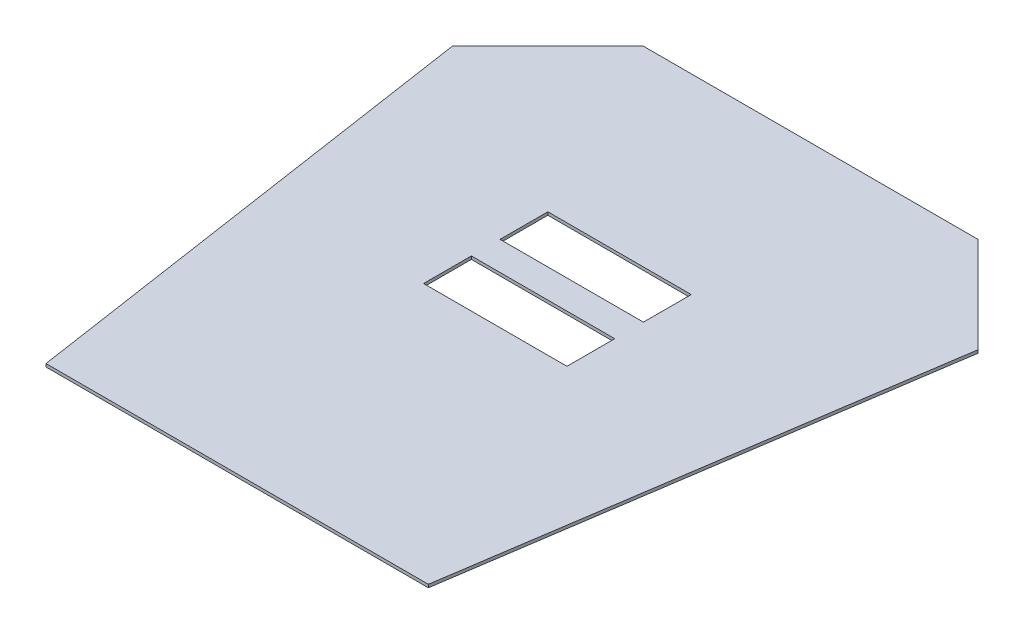
ISO-10303-21;
HEADER;
FILE_DESCRIPTION(('STEP AP214'),'2;1');
FILE_NAME('part.step','',(''),(''),'','','');
FILE_SCHEMA(('AUTOMOTIVE_DESIGN { 1 0 10303 214 1 1 1 1 }'));
ENDSEC;
DATA;
#1=APPLICATION_CONTEXT('core data for automotive mechanical design processes');
#2=APPLICATION_PROTOCOL_DEFINITION('international standard','automotive_design',2000,#1);
#3=PRODUCT_CONTEXT('',#1,'mechanical');
#4=PRODUCT('Part','Part','',(#3));
#5=PRODUCT_RELATED_PRODUCT_CATEGORY('part','',(#4));
#6=PRODUCT_DEFINITION_FORMATION('','',#4);
#7=PRODUCT_DEFINITION_CONTEXT('part definition',#1,'design');
#8=PRODUCT_DEFINITION('design','',#6,#7);
#9=PRODUCT_DEFINITION_SHAPE('','',#8);
#10=(LENGTH_UNIT() NAMED_UNIT(*) SI_UNIT(.MILLI.,.METRE.));
#11=(NAMED_UNIT(*) PLANE_ANGLE_UNIT() SI_UNIT($,.RADIAN.));
#12=(NAMED_UNIT(*) SI_UNIT($,.STERADIAN.) SOLID_ANGLE_UNIT());
#13=UNCERTAINTY_MEASURE_WITH_UNIT(LENGTH_MEASURE(1.E-05),#10,'distance_accuracy_value','');
#14=(GEOMETRIC_REPRESENTATION_CONTEXT(3) GLOBAL_UNCERTAINTY_ASSIGNED_CONTEXT((#13)) GLOBAL_UNIT_ASSIGNED_CONTEXT((#10,
#11,#12)) REPRESENTATION_CONTEXT('',''));
#15=CARTESIAN_POINT('',(0.,0.,0.));
#16=DIRECTION('',(0.,0.,1.));
#17=DIRECTION('',(1.,0.,0.));
#18=AXIS2_PLACEMENT_3D('',#15,#16,#17);
#19=CARTESIAN_POINT('',(175.,3.175,-100.));
#20=DIRECTION('',(-0.707106781186547,0.,0.707106781186548));
#21=DIRECTION('',(0.707106781186548,0.,0.707106781186547));
#22=AXIS2_PLACEMENT_3D('',#19,#20,#21);
#23=PLANE('',#22);
#24=DIRECTION('',(-0.707106781186548,0.,-0.707106781186547));
#25=VECTOR('',#24,1.);
#26=CARTESIAN_POINT('',(175.,0.,-100.));
#27=LINE('',#26,#25);
#28=CARTESIAN_POINT('',(275.,0.,0.));
#29=VERTEX_POINT('',#28);
#30=CARTESIAN_POINT('',(175.,0.,-100.));
#31=VERTEX_POINT('',#30);
#32=EDGE_CURVE('E165',#29,#31,#27,.T.);
#33=ORIENTED_EDGE('',*,*,#32,.T.);
#34=DIRECTION('',(0.,-1.,0.));
#35=VECTOR('',#34,1.);
#36=CARTESIAN_POINT('',(175.,3.175,-100.));
#37=LINE('',#36,#35);
#38=CARTESIAN_POINT('',(175.,3.175,-100.));
#39=VERTEX_POINT('',#38);
#40=EDGE_CURVE('E226',#39,#31,#37,.T.);
#41=ORIENTED_EDGE('',*,*,#40,.F.);
#42=DIRECTION('',(-0.707106781186548,0.,-0.707106781186547));
#43=VECTOR('',#42,1.);
#44=CARTESIAN_POINT('',(175.,3.175,-100.));
#45=LINE('',#44,#43);
#46=CARTESIAN_POINT('',(275.,3.175,0.));
#47=VERTEX_POINT('',#46);
#48=EDGE_CURVE('E186',#47,#39,#45,.T.);
#49=ORIENTED_EDGE('',*,*,#48,.F.);
#50=DIRECTION('',(0.,-1.,0.));
#51=VECTOR('',#50,1.);
#52=CARTESIAN_POINT('',(275.,3.175,0.));
#53=LINE('',#52,#51);
#54=EDGE_CURVE('E200',#47,#29,#53,.T.);
#55=ORIENTED_EDGE('',*,*,#54,.T.);
#56=EDGE_LOOP('',(#33,#41,#49,#55));
#57=FACE_BOUND('',#56,.T.);
#58=ADVANCED_FACE('F35',(#57),#23,.F.);
#59=CARTESIAN_POINT('',(-175.,3.175,-99.9999999999999));
#60=DIRECTION('',(0.,0.,1.));
#61=DIRECTION('',(1.,0.,0.));
#62=AXIS2_PLACEMENT_3D('',#59,#60,#61);
#63=PLANE('',#62);
#64=DIRECTION('',(-1.,0.,0.));
#65=VECTOR('',#64,1.);
#66=CARTESIAN_POINT('',(-175.,0.,-99.9999999999999));
#67=LINE('',#66,#65);
#68=CARTESIAN_POINT('',(-175.,0.,-99.9999999999999));
#69=VERTEX_POINT('',#68);
#70=EDGE_CURVE('E203',#31,#69,#67,.T.);
#71=ORIENTED_EDGE('',*,*,#70,.T.);
#72=DIRECTION('',(0.,-1.,0.));
#73=VECTOR('',#72,1.);
#74=CARTESIAN_POINT('',(-175.,3.175,-99.9999999999999));
#75=LINE('',#74,#73);
#76=CARTESIAN_POINT('',(-175.,3.175,-99.9999999999999));
#77=VERTEX_POINT('',#76);
#78=EDGE_CURVE('E223',#77,#69,#75,.T.);
#79=ORIENTED_EDGE('',*,*,#78,.F.);
#80=DIRECTION('',(-1.,0.,0.));
#81=VECTOR('',#80,1.);
#82=CARTESIAN_POINT('',(-175.,3.175,-99.9999999999999));
#83=LINE('',#82,#81);
#84=EDGE_CURVE('E189',#39,#77,#83,.T.);
#85=ORIENTED_EDGE('',*,*,#84,.F.);
#86=ORIENTED_EDGE('',*,*,#40,.T.);
#87=EDGE_LOOP('',(#71,#79,#85,#86));
#88=FACE_BOUND('',#87,.T.);
#89=ADVANCED_FACE('F263',(#88),#63,.F.);
#90=CARTESIAN_POINT('',(-175.,3.175,-99.9999999999999));
#91=DIRECTION('',(0.707106781186547,0.,0.707106781186548));
#92=DIRECTION('',(0.707106781186548,0.,-0.707106781186547));
#93=AXIS2_PLACEMENT_3D('',#90,#91,#92);
#94=PLANE('',#93);
#95=DIRECTION('',(-0.707106781186548,0.,0.707106781186547));
#96=VECTOR('',#95,1.);
#97=CARTESIAN_POINT('',(-175.,0.,-99.9999999999999));
#98=LINE('',#97,#96);
#99=CARTESIAN_POINT('',(-275.,0.,0.));
#100=VERTEX_POINT('',#99);
#101=EDGE_CURVE('E205',#69,#100,#98,.T.);
#102=ORIENTED_EDGE('',*,*,#101,.T.);
#103=DIRECTION('',(0.,-1.,0.));
#104=VECTOR('',#103,1.);
#105=CARTESIAN_POINT('',(-275.,3.175,0.));
#106=LINE('',#105,#104);
#107=CARTESIAN_POINT('',(-275.,3.175,0.));
#108=VERTEX_POINT('',#107);
#109=EDGE_CURVE('E220',#108,#100,#106,.T.);
#110=ORIENTED_EDGE('',*,*,#109,.F.);
#111=DIRECTION('',(-0.707106781186548,0.,0.707106781186547));
#112=VECTOR('',#111,1.);
#113=CARTESIAN_POINT('',(-175.,3.175,-99.9999999999999));
#114=LINE('',#113,#112);
#115=EDGE_CURVE('E192',#77,#108,#114,.T.);
#116=ORIENTED_EDGE('',*,*,#115,.F.);
#117=ORIENTED_EDGE('',*,*,#78,.T.);
#118=EDGE_LOOP('',(#102,#110,#116,#117));
#119=FACE_BOUND('',#118,.T.);
#120=ADVANCED_FACE('F268',(#119),#94,.F.);
#121=CARTESIAN_POINT('',(-275.,3.175,0.));
#122=DIRECTION('',(0.988936352868297,0.,-0.148340452930245));
#123=DIRECTION('',(-0.148340452930245,0.,-0.988936352868298));
#124=AXIS2_PLACEMENT_3D('',#121,#122,#123);
#125=PLANE('',#124);
#126=DIRECTION('',(0.148340452930245,0.,0.988936352868298));
#127=VECTOR('',#126,1.);
#128=CARTESIAN_POINT('',(-275.,0.,0.));
#129=LINE('',#128,#127);
#130=CARTESIAN_POINT('',(-200.,0.,500.));
#131=VERTEX_POINT('',#130);
#132=EDGE_CURVE('E207',#100,#131,#129,.T.);
#133=ORIENTED_EDGE('',*,*,#132,.T.);
#134=DIRECTION('',(0.,-1.,0.));
#135=VECTOR('',#134,1.);
#136=CARTESIAN_POINT('',(-200.,3.175,500.));
#137=LINE('',#136,#135);
#138=CARTESIAN_POINT('',(-200.,3.175,500.));
#139=VERTEX_POINT('',#138);
#140=EDGE_CURVE('E217',#139,#131,#137,.T.);
#141=ORIENTED_EDGE('',*,*,#140,.F.);
#142=DIRECTION('',(0.148340452930245,0.,0.988936352868298));
#143=VECTOR('',#142,1.);
#144=CARTESIAN_POINT('',(-275.,3.175,0.));
#145=LINE('',#144,#143);
#146=EDGE_CURVE('E194',#108,#139,#145,.T.);
#147=ORIENTED_EDGE('',*,*,#146,.F.);
#148=ORIENTED_EDGE('',*,*,#109,.T.);
#149=EDGE_LOOP('',(#133,#141,#147,#148));
#150=FACE_BOUND('',#149,.T.);
#151=ADVANCED_FACE('F291',(#150),#125,.F.);
#152=CARTESIAN_POINT('',(200.,3.175,500.));
#153=DIRECTION('',(0.,0.,-1.));
#154=DIRECTION('',(-1.,0.,0.));
#155=AXIS2_PLACEMENT_3D('',#152,#153,#154);
#156=PLANE('',#155);
#157=DIRECTION('',(1.,0.,0.));
#158=VECTOR('',#157,1.);
#159=CARTESIAN_POINT('',(200.,0.,500.));
#160=LINE('',#159,#158);
#161=CARTESIAN_POINT('',(200.,0.,500.));
#162=VERTEX_POINT('',#161);
#163=EDGE_CURVE('E209',#131,#162,#160,.T.);
#164=ORIENTED_EDGE('',*,*,#163,.T.);
#165=DIRECTION('',(0.,-1.,0.));
#166=VECTOR('',#165,1.);
#167=CARTESIAN_POINT('',(200.,3.175,500.));
#168=LINE('',#167,#166);
#169=CARTESIAN_POINT('',(200.,3.175,500.));
#170=VERTEX_POINT('',#169);
#171=EDGE_CURVE('E214',#170,#162,#168,.T.);
#172=ORIENTED_EDGE('',*,*,#171,.F.);
#173=DIRECTION('',(1.,0.,0.));
#174=VECTOR('',#173,1.);
#175=CARTESIAN_POINT('',(200.,3.175,500.));
#176=LINE('',#175,#174);
#177=EDGE_CURVE('E196',#139,#170,#176,.T.);
#178=ORIENTED_EDGE('',*,*,#177,.F.);
#179=ORIENTED_EDGE('',*,*,#140,.T.);
#180=EDGE_LOOP('',(#164,#172,#178,#179));
#181=FACE_BOUND('',#180,.T.);
#182=ADVANCED_FACE('F288',(#181),#156,.F.);
#183=CARTESIAN_POINT('',(275.,3.175,0.));
#184=DIRECTION('',(-0.988936352868297,0.,-0.148340452930244));
#185=DIRECTION('',(-0.148340452930245,0.,0.988936352868298));
#186=AXIS2_PLACEMENT_3D('',#183,#184,#185);
#187=PLANE('',#186);
#188=DIRECTION('',(0.148340452930244,0.,-0.988936352868298));
#189=VECTOR('',#188,1.);
#190=CARTESIAN_POINT('',(275.,0.,0.));
#191=LINE('',#190,#189);
#192=EDGE_CURVE('E190',#162,#29,#191,.T.);
#193=ORIENTED_EDGE('',*,*,#192,.T.);
#194=ORIENTED_EDGE('',*,*,#54,.F.);
#195=DIRECTION('',(0.148340452930244,0.,-0.988936352868298));
#196=VECTOR('',#195,1.);
#197=CARTESIAN_POINT('',(275.,3.175,0.));
#198=LINE('',#197,#196);
#199=EDGE_CURVE('E198',#170,#47,#198,.T.);
#200=ORIENTED_EDGE('',*,*,#199,.F.);
#201=ORIENTED_EDGE('',*,*,#171,.T.);
#202=EDGE_LOOP('',(#193,#194,#200,#201));
#203=FACE_BOUND('',#202,.T.);
#204=ADVANCED_FACE('F286',(#203),#187,.F.);
#205=CARTESIAN_POINT('',(0.,3.175,0.));
#206=DIRECTION('',(0.,-1.,0.));
#207=DIRECTION('',(0.,0.,-1.));
#208=AXIS2_PLACEMENT_3D('',#205,#206,#207);
#209=PLANE('',#208);
#210=DIRECTION('',(-1.,0.,0.));
#211=VECTOR('',#210,1.);
#212=CARTESIAN_POINT('',(75.,3.175,180.));
#213=LINE('',#212,#211);
#214=CARTESIAN_POINT('',(75.,3.175,180.));
#215=VERTEX_POINT('',#214);
#216=CARTESIAN_POINT('',(-75.,3.175,180.));
#217=VERTEX_POINT('',#216);
#218=EDGE_CURVE('E151',#215,#217,#213,.T.);
#219=ORIENTED_EDGE('',*,*,#218,.F.);
#220=DIRECTION('',(0.,0.,-1.));
#221=VECTOR('',#220,1.);
#222=CARTESIAN_POINT('',(75.,3.175,230.));
#223=LINE('',#222,#221);
#224=CARTESIAN_POINT('',(75.,3.175,230.));
#225=VERTEX_POINT('',#224);
#226=EDGE_CURVE('E49',#225,#215,#223,.T.);
#227=ORIENTED_EDGE('',*,*,#226,.F.);
#228=DIRECTION('',(1.,0.,0.));
#229=VECTOR('',#228,1.);
#230=CARTESIAN_POINT('',(75.,3.175,230.));
#231=LINE('',#230,#229);
#232=CARTESIAN_POINT('',(-75.,3.175,230.));
#233=VERTEX_POINT('',#232);
#234=EDGE_CURVE('E158',#233,#225,#231,.T.);
#235=ORIENTED_EDGE('',*,*,#234,.F.);
#236=DIRECTION('',(0.,0.,1.));
#237=VECTOR('',#236,1.);
#238=CARTESIAN_POINT('',(-75.,3.175,230.));
#239=LINE('',#238,#237);
#240=EDGE_CURVE('E141',#217,#233,#239,.T.);
#241=ORIENTED_EDGE('',*,*,#240,.F.);
#242=EDGE_LOOP('',(#219,#227,#235,#241));
#243=FACE_BOUND('',#242,.T.);
#244=DIRECTION('',(-1.,0.,0.));
#245=VECTOR('',#244,1.);
#246=CARTESIAN_POINT('',(75.,3.175,100.));
#247=LINE('',#246,#245);
#248=CARTESIAN_POINT('',(75.,3.175,100.));
#249=VERTEX_POINT('',#248);
#250=CARTESIAN_POINT('',(-75.,3.175,100.));
#251=VERTEX_POINT('',#250);
#252=EDGE_CURVE('E169',#249,#251,#247,.T.);
#253=ORIENTED_EDGE('',*,*,#252,.F.);
#254=DIRECTION('',(0.,0.,-1.));
#255=VECTOR('',#254,1.);
#256=CARTESIAN_POINT('',(75.,3.175,150.));
#257=LINE('',#256,#255);
#258=CARTESIAN_POINT('',(75.,3.175,150.));
#259=VERTEX_POINT('',#258);
#260=EDGE_CURVE('E57',#259,#249,#257,.T.);
#261=ORIENTED_EDGE('',*,*,#260,.F.);
#262=DIRECTION('',(1.,0.,0.));
#263=VECTOR('',#262,1.);
#264=CARTESIAN_POINT('',(75.,3.175,150.));
#265=LINE('',#264,#263);
#266=CARTESIAN_POINT('',(-75.,3.175,150.));
#267=VERTEX_POINT('',#266);
#268=EDGE_CURVE('E175',#267,#259,#265,.T.);
#269=ORIENTED_EDGE('',*,*,#268,.F.);
#270=DIRECTION('',(0.,0.,1.));
#271=VECTOR('',#270,1.);
#272=CARTESIAN_POINT('',(-75.,3.175,150.));
#273=LINE('',#272,#271);
#274=EDGE_CURVE('E172',#251,#267,#273,.T.);
#275=ORIENTED_EDGE('',*,*,#274,.F.);
#276=EDGE_LOOP('',(#253,#261,#269,#275));
#277=FACE_BOUND('',#276,.T.);
#278=ORIENTED_EDGE('',*,*,#48,.T.);
#279=ORIENTED_EDGE('',*,*,#84,.T.);
#280=ORIENTED_EDGE('',*,*,#115,.T.);
#281=ORIENTED_EDGE('',*,*,#146,.T.);
#282=ORIENTED_EDGE('',*,*,#177,.T.);
#283=ORIENTED_EDGE('',*,*,#199,.T.);
#284=EDGE_LOOP('',(#278,#279,#280,#281,#282,#283));
#285=FACE_BOUND('',#284,.T.);
#286=ADVANCED_FACE('F155',(#243,#277,#285),#209,.F.);
#287=CARTESIAN_POINT('',(0.,0.,0.));
#288=DIRECTION('',(0.,-1.,0.));
#289=DIRECTION('',(0.,0.,-1.));
#290=AXIS2_PLACEMENT_3D('',#287,#288,#289);
#291=PLANE('',#290);
#292=DIRECTION('',(0.,0.,1.));
#293=VECTOR('',#292,1.);
#294=CARTESIAN_POINT('',(75.,0.,0.));
#295=LINE('',#294,#293);
#296=CARTESIAN_POINT('',(75.,0.,180.));
#297=VERTEX_POINT('',#296);
#298=CARTESIAN_POINT('',(75.,0.,230.));
#299=VERTEX_POINT('',#298);
#300=EDGE_CURVE('E11',#297,#299,#295,.T.);
#301=ORIENTED_EDGE('',*,*,#300,.F.);
#302=DIRECTION('',(1.,0.,0.));
#303=VECTOR('',#302,1.);
#304=CARTESIAN_POINT('',(0.,0.,180.));
#305=LINE('',#304,#303);
#306=CARTESIAN_POINT('',(-75.,0.,180.));
#307=VERTEX_POINT('',#306);
#308=EDGE_CURVE('E238',#307,#297,#305,.T.);
#309=ORIENTED_EDGE('',*,*,#308,.F.);
#310=DIRECTION('',(0.,0.,-1.));
#311=VECTOR('',#310,1.);
#312=CARTESIAN_POINT('',(-75.,0.,0.));
#313=LINE('',#312,#311);
#314=CARTESIAN_POINT('',(-75.,0.,230.));
#315=VERTEX_POINT('',#314);
#316=EDGE_CURVE('E144',#315,#307,#313,.T.);
#317=ORIENTED_EDGE('',*,*,#316,.F.);
#318=DIRECTION('',(-1.,0.,0.));
#319=VECTOR('',#318,1.);
#320=CARTESIAN_POINT('',(0.,0.,230.));
#321=LINE('',#320,#319);
#322=EDGE_CURVE('E42',#299,#315,#321,.T.);
#323=ORIENTED_EDGE('',*,*,#322,.F.);
#324=EDGE_LOOP('',(#301,#309,#317,#323));
#325=FACE_BOUND('',#324,.T.);
#326=DIRECTION('',(0.,0.,1.));
#327=VECTOR('',#326,1.);
#328=CARTESIAN_POINT('',(75.,0.,0.));
#329=LINE('',#328,#327);
#330=CARTESIAN_POINT('',(75.,0.,100.));
#331=VERTEX_POINT('',#330);
#332=CARTESIAN_POINT('',(75.,0.,150.));
#333=VERTEX_POINT('',#332);
#334=EDGE_CURVE('E236',#331,#333,#329,.T.);
#335=ORIENTED_EDGE('',*,*,#334,.F.);
#336=DIRECTION('',(1.,0.,0.));
#337=VECTOR('',#336,1.);
#338=CARTESIAN_POINT('',(0.,0.,100.));
#339=LINE('',#338,#337);
#340=CARTESIAN_POINT('',(-75.,0.,100.));
#341=VERTEX_POINT('',#340);
#342=EDGE_CURVE('E229',#341,#331,#339,.T.);
#343=ORIENTED_EDGE('',*,*,#342,.F.);
#344=DIRECTION('',(0.,0.,-1.));
#345=VECTOR('',#344,1.);
#346=CARTESIAN_POINT('',(-75.,0.,0.));
#347=LINE('',#346,#345);
#348=CARTESIAN_POINT('',(-75.,0.,150.));
#349=VERTEX_POINT('',#348);
#350=EDGE_CURVE('E231',#349,#341,#347,.T.);
#351=ORIENTED_EDGE('',*,*,#350,.F.);
#352=DIRECTION('',(-1.,0.,0.));
#353=VECTOR('',#352,1.);
#354=CARTESIAN_POINT('',(0.,0.,150.));
#355=LINE('',#354,#353);
#356=EDGE_CURVE('E234',#333,#349,#355,.T.);
#357=ORIENTED_EDGE('',*,*,#356,.F.);
#358=EDGE_LOOP('',(#335,#343,#351,#357));
#359=FACE_BOUND('',#358,.T.);
#360=ORIENTED_EDGE('',*,*,#32,.F.);
#361=ORIENTED_EDGE('',*,*,#192,.F.);
#362=ORIENTED_EDGE('',*,*,#163,.F.);
#363=ORIENTED_EDGE('',*,*,#132,.F.);
#364=ORIENTED_EDGE('',*,*,#101,.F.);
#365=ORIENTED_EDGE('',*,*,#70,.F.);
#366=EDGE_LOOP('',(#360,#361,#362,#363,#364,#365));
#367=FACE_BOUND('',#366,.T.);
#368=ADVANCED_FACE('F246',(#325,#359,#367),#291,.T.);
#369=CARTESIAN_POINT('',(75.,-6.825,150.));
#370=DIRECTION('',(1.,0.,0.));
#371=DIRECTION('',(0.,0.,-1.));
#372=AXIS2_PLACEMENT_3D('',#369,#370,#371);
#373=PLANE('',#372);
#374=ORIENTED_EDGE('',*,*,#334,.T.);
#375=DIRECTION('',(0.,1.,0.));
#376=VECTOR('',#375,1.);
#377=CARTESIAN_POINT('',(75.,-6.825,150.));
#378=LINE('',#377,#376);
#379=EDGE_CURVE('E179',#333,#259,#378,.T.);
#380=ORIENTED_EDGE('',*,*,#379,.T.);
#381=ORIENTED_EDGE('',*,*,#260,.T.);
#382=DIRECTION('',(0.,1.,0.));
#383=VECTOR('',#382,1.);
#384=CARTESIAN_POINT('',(75.,-6.825,100.));
#385=LINE('',#384,#383);
#386=EDGE_CURVE('E178',#331,#249,#385,.T.);
#387=ORIENTED_EDGE('',*,*,#386,.F.);
#388=EDGE_LOOP('',(#374,#380,#381,#387));
#389=FACE_BOUND('',#388,.T.);
#390=ADVANCED_FACE('F308',(#389),#373,.F.);
#391=CARTESIAN_POINT('',(75.,-6.825,150.));
#392=DIRECTION('',(0.,0.,1.));
#393=DIRECTION('',(1.,0.,0.));
#394=AXIS2_PLACEMENT_3D('',#391,#392,#393);
#395=PLANE('',#394);
#396=ORIENTED_EDGE('',*,*,#356,.T.);
#397=DIRECTION('',(0.,1.,0.));
#398=VECTOR('',#397,1.);
#399=CARTESIAN_POINT('',(-75.,-6.825,150.));
#400=LINE('',#399,#398);
#401=EDGE_CURVE('E181',#349,#267,#400,.T.);
#402=ORIENTED_EDGE('',*,*,#401,.T.);
#403=ORIENTED_EDGE('',*,*,#268,.T.);
#404=ORIENTED_EDGE('',*,*,#379,.F.);
#405=EDGE_LOOP('',(#396,#402,#403,#404));
#406=FACE_BOUND('',#405,.T.);
#407=ADVANCED_FACE('F312',(#406),#395,.F.);
#408=CARTESIAN_POINT('',(-75.,-6.825,150.));
#409=DIRECTION('',(-1.,0.,0.));
#410=DIRECTION('',(0.,0.,1.));
#411=AXIS2_PLACEMENT_3D('',#408,#409,#410);
#412=PLANE('',#411);
#413=ORIENTED_EDGE('',*,*,#350,.T.);
#414=DIRECTION('',(0.,1.,0.));
#415=VECTOR('',#414,1.);
#416=CARTESIAN_POINT('',(-75.,-6.825,100.));
#417=LINE('',#416,#415);
#418=EDGE_CURVE('E183',#341,#251,#417,.T.);
#419=ORIENTED_EDGE('',*,*,#418,.T.);
#420=ORIENTED_EDGE('',*,*,#274,.T.);
#421=ORIENTED_EDGE('',*,*,#401,.F.);
#422=EDGE_LOOP('',(#413,#419,#420,#421));
#423=FACE_BOUND('',#422,.T.);
#424=ADVANCED_FACE('F257',(#423),#412,.F.);
#425=CARTESIAN_POINT('',(75.,-6.825,100.));
#426=DIRECTION('',(0.,0.,-1.));
#427=DIRECTION('',(-1.,0.,0.));
#428=AXIS2_PLACEMENT_3D('',#425,#426,#427);
#429=PLANE('',#428);
#430=ORIENTED_EDGE('',*,*,#342,.T.);
#431=ORIENTED_EDGE('',*,*,#386,.T.);
#432=ORIENTED_EDGE('',*,*,#252,.T.);
#433=ORIENTED_EDGE('',*,*,#418,.F.);
#434=EDGE_LOOP('',(#430,#431,#432,#433));
#435=FACE_BOUND('',#434,.T.);
#436=ADVANCED_FACE('F250',(#435),#429,.F.);
#437=CARTESIAN_POINT('',(75.,-6.825,230.));
#438=DIRECTION('',(1.,0.,0.));
#439=DIRECTION('',(0.,0.,-1.));
#440=AXIS2_PLACEMENT_3D('',#437,#438,#439);
#441=PLANE('',#440);
#442=ORIENTED_EDGE('',*,*,#300,.T.);
#443=DIRECTION('',(0.,1.,0.));
#444=VECTOR('',#443,1.);
#445=CARTESIAN_POINT('',(75.,-6.825,230.));
#446=LINE('',#445,#444);
#447=EDGE_CURVE('E163',#299,#225,#446,.T.);
#448=ORIENTED_EDGE('',*,*,#447,.T.);
#449=ORIENTED_EDGE('',*,*,#226,.T.);
#450=DIRECTION('',(0.,1.,0.));
#451=VECTOR('',#450,1.);
#452=CARTESIAN_POINT('',(75.,-6.825,180.));
#453=LINE('',#452,#451);
#454=EDGE_CURVE('E148',#297,#215,#453,.T.);
#455=ORIENTED_EDGE('',*,*,#454,.F.);
#456=EDGE_LOOP('',(#442,#448,#449,#455));
#457=FACE_BOUND('',#456,.T.);
#458=ADVANCED_FACE('F248',(#457),#441,.F.);
#459=CARTESIAN_POINT('',(75.,-6.825,230.));
#460=DIRECTION('',(0.,0.,1.));
#461=DIRECTION('',(1.,0.,0.));
#462=AXIS2_PLACEMENT_3D('',#459,#460,#461);
#463=PLANE('',#462);
#464=ORIENTED_EDGE('',*,*,#322,.T.);
#465=DIRECTION('',(0.,1.,0.));
#466=VECTOR('',#465,1.);
#467=CARTESIAN_POINT('',(-75.,-6.825,230.));
#468=LINE('',#467,#466);
#469=EDGE_CURVE('E147',#315,#233,#468,.T.);
#470=ORIENTED_EDGE('',*,*,#469,.T.);
#471=ORIENTED_EDGE('',*,*,#234,.T.);
#472=ORIENTED_EDGE('',*,*,#447,.F.);
#473=EDGE_LOOP('',(#464,#470,#471,#472));
#474=FACE_BOUND('',#473,.T.);
#475=ADVANCED_FACE('F243',(#474),#463,.F.);
#476=CARTESIAN_POINT('',(-75.,-6.825,230.));
#477=DIRECTION('',(-1.,0.,0.));
#478=DIRECTION('',(0.,0.,1.));
#479=AXIS2_PLACEMENT_3D('',#476,#477,#478);
#480=PLANE('',#479);
#481=ORIENTED_EDGE('',*,*,#316,.T.);
#482=DIRECTION('',(0.,1.,0.));
#483=VECTOR('',#482,1.);
#484=CARTESIAN_POINT('',(-75.,-6.825,180.));
#485=LINE('',#484,#483);
#486=EDGE_CURVE('E136',#307,#217,#485,.T.);
#487=ORIENTED_EDGE('',*,*,#486,.T.);
#488=ORIENTED_EDGE('',*,*,#240,.T.);
#489=ORIENTED_EDGE('',*,*,#469,.F.);
#490=EDGE_LOOP('',(#481,#487,#488,#489));
#491=FACE_BOUND('',#490,.T.);
#492=ADVANCED_FACE('F138',(#491),#480,.F.);
#493=CARTESIAN_POINT('',(75.,-6.825,180.));
#494=DIRECTION('',(0.,0.,-1.));
#495=DIRECTION('',(-1.,0.,0.));
#496=AXIS2_PLACEMENT_3D('',#493,#494,#495);
#497=PLANE('',#496);
#498=ORIENTED_EDGE('',*,*,#308,.T.);
#499=ORIENTED_EDGE('',*,*,#454,.T.);
#500=ORIENTED_EDGE('',*,*,#218,.T.);
#501=ORIENTED_EDGE('',*,*,#486,.F.);
#502=EDGE_LOOP('',(#498,#499,#500,#501));
#503=FACE_BOUND('',#502,.T.);
#504=ADVANCED_FACE('F152',(#503),#497,.F.);
#505=CLOSED_SHELL('',(#58,#89,#120,#151,#182,#204,#286,#368,#390,#407,#424,#436,#458,#475,#492,#504));
#506=MANIFOLD_SOLID_BREP('B2',#505);
#507=ADVANCED_BREP_SHAPE_REPRESENTATION('',(#18,#506),#14);
#508=SHAPE_DEFINITION_REPRESENTATION(#9,#507);
ENDSEC;
END-ISO-10303-21;
